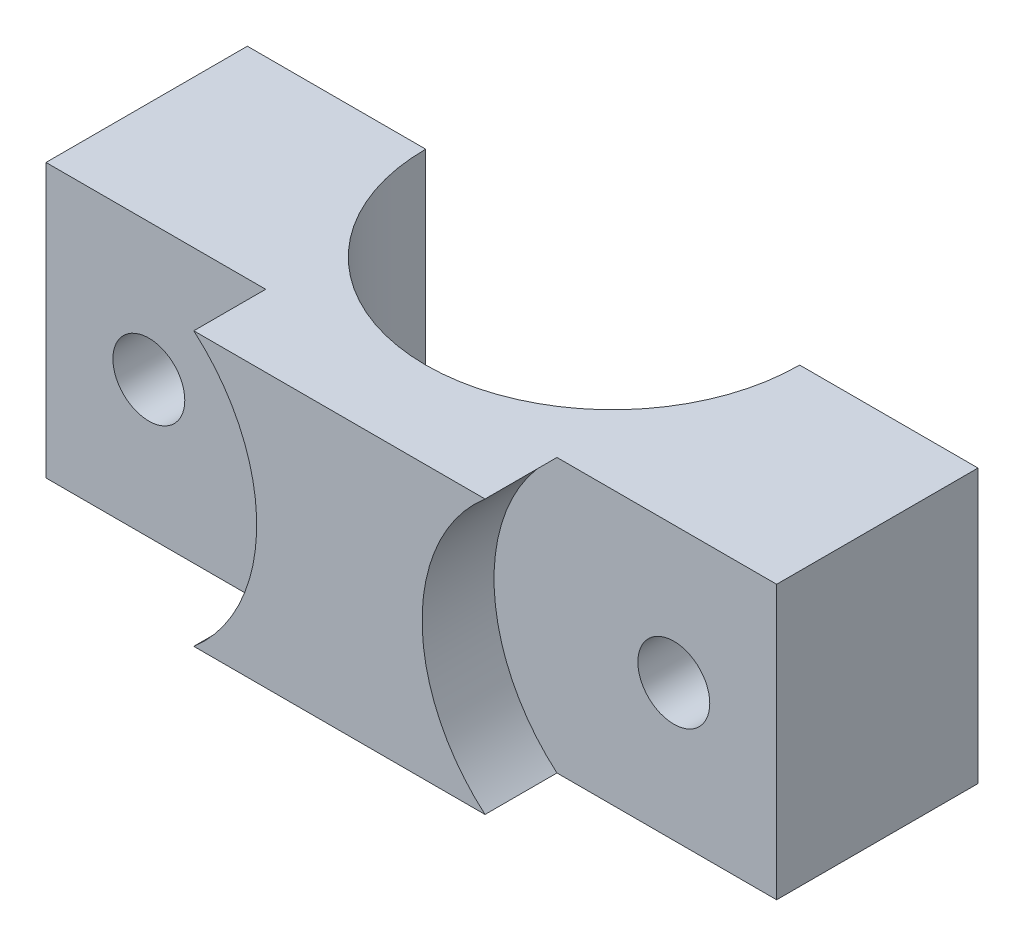
ISO-10303-21;
HEADER;
FILE_DESCRIPTION(('STEP AP214'),'2;1');
FILE_NAME('part.step','',(''),(''),'','','');
FILE_SCHEMA(('AUTOMOTIVE_DESIGN { 1 0 10303 214 1 1 1 1 }'));
ENDSEC;
DATA;
#1=APPLICATION_CONTEXT('core data for automotive mechanical design processes');
#2=APPLICATION_PROTOCOL_DEFINITION('international standard','automotive_design',2000,#1);
#3=PRODUCT_CONTEXT('',#1,'mechanical');
#4=PRODUCT('Part','Part','',(#3));
#5=PRODUCT_RELATED_PRODUCT_CATEGORY('part','',(#4));
#6=PRODUCT_DEFINITION_FORMATION('','',#4);
#7=PRODUCT_DEFINITION_CONTEXT('part definition',#1,'design');
#8=PRODUCT_DEFINITION('design','',#6,#7);
#9=PRODUCT_DEFINITION_SHAPE('','',#8);
#10=(LENGTH_UNIT() NAMED_UNIT(*) SI_UNIT(.MILLI.,.METRE.));
#11=(NAMED_UNIT(*) PLANE_ANGLE_UNIT() SI_UNIT($,.RADIAN.));
#12=(NAMED_UNIT(*) SI_UNIT($,.STERADIAN.) SOLID_ANGLE_UNIT());
#13=UNCERTAINTY_MEASURE_WITH_UNIT(LENGTH_MEASURE(1.E-05),#10,'distance_accuracy_value','');
#14=(GEOMETRIC_REPRESENTATION_CONTEXT(3) GLOBAL_UNCERTAINTY_ASSIGNED_CONTEXT((#13)) GLOBAL_UNIT_ASSIGNED_CONTEXT((#10,
#11,#12)) REPRESENTATION_CONTEXT('',''));
#15=CARTESIAN_POINT('',(0.,0.,0.));
#16=DIRECTION('',(0.,0.,1.));
#17=DIRECTION('',(1.,0.,0.));
#18=AXIS2_PLACEMENT_3D('',#15,#16,#17);
#19=CARTESIAN_POINT('',(25.4,9.5,19.));
#20=DIRECTION('',(-1.,0.,0.));
#21=DIRECTION('',(0.,0.,1.));
#22=AXIS2_PLACEMENT_3D('',#19,#20,#21);
#23=PLANE('',#22);
#24=DIRECTION('',(0.,1.,0.));
#25=VECTOR('',#24,1.);
#26=CARTESIAN_POINT('',(25.4,0.,14.));
#27=LINE('',#26,#25);
#28=CARTESIAN_POINT('',(25.4,-9.5,14.));
#29=VERTEX_POINT('',#28);
#30=CARTESIAN_POINT('',(25.4,9.5,14.));
#31=VERTEX_POINT('',#30);
#32=EDGE_CURVE('E145',#29,#31,#27,.T.);
#33=ORIENTED_EDGE('',*,*,#32,.F.);
#34=DIRECTION('',(0.,0.,-1.));
#35=VECTOR('',#34,1.);
#36=CARTESIAN_POINT('',(25.4,-9.5,19.));
#37=LINE('',#36,#35);
#38=CARTESIAN_POINT('',(25.4,-9.5,0.));
#39=VERTEX_POINT('',#38);
#40=EDGE_CURVE('E165',#29,#39,#37,.T.);
#41=ORIENTED_EDGE('',*,*,#40,.T.);
#42=DIRECTION('',(0.,1.,0.));
#43=VECTOR('',#42,1.);
#44=CARTESIAN_POINT('',(25.4,9.5,0.));
#45=LINE('',#44,#43);
#46=CARTESIAN_POINT('',(25.4,9.5,0.));
#47=VERTEX_POINT('',#46);
#48=EDGE_CURVE('E158',#39,#47,#45,.T.);
#49=ORIENTED_EDGE('',*,*,#48,.T.);
#50=DIRECTION('',(0.,0.,-1.));
#51=VECTOR('',#50,1.);
#52=CARTESIAN_POINT('',(25.4,9.5,19.));
#53=LINE('',#52,#51);
#54=EDGE_CURVE('E183',#31,#47,#53,.T.);
#55=ORIENTED_EDGE('',*,*,#54,.F.);
#56=EDGE_LOOP('',(#33,#41,#49,#55));
#57=FACE_BOUND('',#56,.T.);
#58=ADVANCED_FACE('F37',(#57),#23,.F.);
#59=CARTESIAN_POINT('',(-25.4,9.5,19.));
#60=DIRECTION('',(0.,-1.,0.));
#61=DIRECTION('',(0.,0.,-1.));
#62=AXIS2_PLACEMENT_3D('',#59,#60,#61);
#63=PLANE('',#62);
#64=DIRECTION('',(-1.,0.,0.));
#65=VECTOR('',#64,1.);
#66=CARTESIAN_POINT('',(0.,9.5,14.));
#67=LINE('',#66,#65);
#68=CARTESIAN_POINT('',(-10.125961595364,9.5,14.));
#69=VERTEX_POINT('',#68);
#70=CARTESIAN_POINT('',(-25.4,9.5,14.));
#71=VERTEX_POINT('',#70);
#72=EDGE_CURVE('E118',#69,#71,#67,.T.);
#73=ORIENTED_EDGE('',*,*,#72,.F.);
#74=DIRECTION('',(0.,0.,1.));
#75=VECTOR('',#74,1.);
#76=CARTESIAN_POINT('',(-10.125961595364,9.5,14.));
#77=LINE('',#76,#75);
#78=CARTESIAN_POINT('',(-10.125961595364,9.5,19.));
#79=VERTEX_POINT('',#78);
#80=EDGE_CURVE('E115',#69,#79,#77,.T.);
#81=ORIENTED_EDGE('',*,*,#80,.T.);
#82=DIRECTION('',(-1.,0.,0.));
#83=VECTOR('',#82,1.);
#84=CARTESIAN_POINT('',(-25.4,9.5,19.));
#85=LINE('',#84,#83);
#86=CARTESIAN_POINT('',(10.125961595364,9.5,19.));
#87=VERTEX_POINT('',#86);
#88=EDGE_CURVE('E160',#87,#79,#85,.T.);
#89=ORIENTED_EDGE('',*,*,#88,.F.);
#90=DIRECTION('',(0.,0.,1.));
#91=VECTOR('',#90,1.);
#92=CARTESIAN_POINT('',(10.125961595364,9.5,14.));
#93=LINE('',#92,#91);
#94=CARTESIAN_POINT('',(10.125961595364,9.5,14.));
#95=VERTEX_POINT('',#94);
#96=EDGE_CURVE('E59',#95,#87,#93,.T.);
#97=ORIENTED_EDGE('',*,*,#96,.F.);
#98=DIRECTION('',(-1.,0.,0.));
#99=VECTOR('',#98,1.);
#100=CARTESIAN_POINT('',(0.,9.5,14.));
#101=LINE('',#100,#99);
#102=EDGE_CURVE('E147',#31,#95,#101,.T.);
#103=ORIENTED_EDGE('',*,*,#102,.F.);
#104=ORIENTED_EDGE('',*,*,#54,.T.);
#105=DIRECTION('',(-1.,0.,0.));
#106=VECTOR('',#105,1.);
#107=CARTESIAN_POINT('',(-25.4,9.5,0.));
#108=LINE('',#107,#106);
#109=CARTESIAN_POINT('',(13.,9.5,0.));
#110=VERTEX_POINT('',#109);
#111=EDGE_CURVE('E169',#47,#110,#108,.T.);
#112=ORIENTED_EDGE('',*,*,#111,.T.);
#113=CARTESIAN_POINT('',(0.,9.5,0.));
#114=DIRECTION('',(0.,-1.,0.));
#115=DIRECTION('',(0.,0.,-1.));
#116=AXIS2_PLACEMENT_3D('',#113,#114,#115);
#117=CIRCLE('',#116,13.);
#118=CARTESIAN_POINT('',(-13.,9.5,0.));
#119=VERTEX_POINT('',#118);
#120=EDGE_CURVE('E155',#110,#119,#117,.T.);
#121=ORIENTED_EDGE('',*,*,#120,.T.);
#122=CARTESIAN_POINT('',(-25.4,9.5,0.));
#123=VERTEX_POINT('',#122);
#124=EDGE_CURVE('E168',#119,#123,#108,.T.);
#125=ORIENTED_EDGE('',*,*,#124,.T.);
#126=DIRECTION('',(0.,0.,-1.));
#127=VECTOR('',#126,1.);
#128=CARTESIAN_POINT('',(-25.4,9.5,19.));
#129=LINE('',#128,#127);
#130=EDGE_CURVE('E181',#71,#123,#129,.T.);
#131=ORIENTED_EDGE('',*,*,#130,.F.);
#132=EDGE_LOOP('',(#73,#81,#89,#97,#103,#104,#112,#121,#125,#131));
#133=FACE_BOUND('',#132,.T.);
#134=ADVANCED_FACE('F194',(#133),#63,.F.);
#135=CARTESIAN_POINT('',(-25.4,9.5,19.));
#136=DIRECTION('',(1.,0.,0.));
#137=DIRECTION('',(0.,0.,-1.));
#138=AXIS2_PLACEMENT_3D('',#135,#136,#137);
#139=PLANE('',#138);
#140=DIRECTION('',(0.,-1.,0.));
#141=VECTOR('',#140,1.);
#142=CARTESIAN_POINT('',(-25.4,0.,14.));
#143=LINE('',#142,#141);
#144=CARTESIAN_POINT('',(-25.4,-9.5,14.));
#145=VERTEX_POINT('',#144);
#146=EDGE_CURVE('E124',#71,#145,#143,.T.);
#147=ORIENTED_EDGE('',*,*,#146,.F.);
#148=ORIENTED_EDGE('',*,*,#130,.T.);
#149=DIRECTION('',(0.,-1.,0.));
#150=VECTOR('',#149,1.);
#151=CARTESIAN_POINT('',(-25.4,9.5,0.));
#152=LINE('',#151,#150);
#153=CARTESIAN_POINT('',(-25.4,-9.5,0.));
#154=VERTEX_POINT('',#153);
#155=EDGE_CURVE('E172',#123,#154,#152,.T.);
#156=ORIENTED_EDGE('',*,*,#155,.T.);
#157=DIRECTION('',(0.,0.,-1.));
#158=VECTOR('',#157,1.);
#159=CARTESIAN_POINT('',(-25.4,-9.5,19.));
#160=LINE('',#159,#158);
#161=EDGE_CURVE('E179',#145,#154,#160,.T.);
#162=ORIENTED_EDGE('',*,*,#161,.F.);
#163=EDGE_LOOP('',(#147,#148,#156,#162));
#164=FACE_BOUND('',#163,.T.);
#165=ADVANCED_FACE('F210',(#164),#139,.F.);
#166=CARTESIAN_POINT('',(-25.4,-9.5,19.));
#167=DIRECTION('',(0.,1.,0.));
#168=DIRECTION('',(0.,0.,1.));
#169=AXIS2_PLACEMENT_3D('',#166,#167,#168);
#170=PLANE('',#169);
#171=DIRECTION('',(1.,0.,0.));
#172=VECTOR('',#171,1.);
#173=CARTESIAN_POINT('',(-25.4,-9.5,19.));
#174=LINE('',#173,#172);
#175=CARTESIAN_POINT('',(-10.125961595364,-9.5,19.));
#176=VERTEX_POINT('',#175);
#177=CARTESIAN_POINT('',(10.125961595364,-9.5,19.));
#178=VERTEX_POINT('',#177);
#179=EDGE_CURVE('E133',#176,#178,#174,.T.);
#180=ORIENTED_EDGE('',*,*,#179,.F.);
#181=DIRECTION('',(0.,0.,1.));
#182=VECTOR('',#181,1.);
#183=CARTESIAN_POINT('',(-10.125961595364,-9.5,14.));
#184=LINE('',#183,#182);
#185=CARTESIAN_POINT('',(-10.125961595364,-9.5,14.));
#186=VERTEX_POINT('',#185);
#187=EDGE_CURVE('E51',#186,#176,#184,.T.);
#188=ORIENTED_EDGE('',*,*,#187,.F.);
#189=DIRECTION('',(1.,0.,0.));
#190=VECTOR('',#189,1.);
#191=CARTESIAN_POINT('',(0.,-9.5,14.));
#192=LINE('',#191,#190);
#193=EDGE_CURVE('E119',#145,#186,#192,.T.);
#194=ORIENTED_EDGE('',*,*,#193,.F.);
#195=ORIENTED_EDGE('',*,*,#161,.T.);
#196=DIRECTION('',(1.,0.,0.));
#197=VECTOR('',#196,1.);
#198=CARTESIAN_POINT('',(-25.4,-9.5,0.));
#199=LINE('',#198,#197);
#200=CARTESIAN_POINT('',(-13.,-9.5,0.));
#201=VERTEX_POINT('',#200);
#202=EDGE_CURVE('E163',#154,#201,#199,.T.);
#203=ORIENTED_EDGE('',*,*,#202,.T.);
#204=CARTESIAN_POINT('',(0.,-9.5,0.));
#205=DIRECTION('',(0.,-1.,0.));
#206=DIRECTION('',(0.,0.,-1.));
#207=AXIS2_PLACEMENT_3D('',#204,#205,#206);
#208=CIRCLE('',#207,13.);
#209=CARTESIAN_POINT('',(13.,-9.5,0.));
#210=VERTEX_POINT('',#209);
#211=EDGE_CURVE('E135',#210,#201,#208,.T.);
#212=ORIENTED_EDGE('',*,*,#211,.F.);
#213=EDGE_CURVE('E175',#210,#39,#199,.T.);
#214=ORIENTED_EDGE('',*,*,#213,.T.);
#215=ORIENTED_EDGE('',*,*,#40,.F.);
#216=DIRECTION('',(1.,0.,0.));
#217=VECTOR('',#216,1.);
#218=CARTESIAN_POINT('',(0.,-9.5,14.));
#219=LINE('',#218,#217);
#220=CARTESIAN_POINT('',(10.125961595364,-9.5,14.));
#221=VERTEX_POINT('',#220);
#222=EDGE_CURVE('E142',#221,#29,#219,.T.);
#223=ORIENTED_EDGE('',*,*,#222,.F.);
#224=DIRECTION('',(0.,0.,1.));
#225=VECTOR('',#224,1.);
#226=CARTESIAN_POINT('',(10.125961595364,-9.5,14.));
#227=LINE('',#226,#225);
#228=EDGE_CURVE('E150',#221,#178,#227,.T.);
#229=ORIENTED_EDGE('',*,*,#228,.T.);
#230=EDGE_LOOP('',(#180,#188,#194,#195,#203,#212,#214,#215,#223,#229));
#231=FACE_BOUND('',#230,.T.);
#232=ADVANCED_FACE('F130',(#231),#170,.F.);
#233=CARTESIAN_POINT('',(0.,0.,19.));
#234=DIRECTION('',(0.,0.,1.));
#235=DIRECTION('',(1.,0.,0.));
#236=AXIS2_PLACEMENT_3D('',#233,#234,#235);
#237=PLANE('',#236);
#238=CARTESIAN_POINT('',(-18.25,0.,19.));
#239=DIRECTION('',(0.,0.,1.));
#240=DIRECTION('',(1.,0.,0.));
#241=AXIS2_PLACEMENT_3D('',#238,#239,#240);
#242=CIRCLE('',#241,12.5);
#243=EDGE_CURVE('E127',#176,#79,#242,.T.);
#244=ORIENTED_EDGE('',*,*,#243,.F.);
#245=ORIENTED_EDGE('',*,*,#179,.T.);
#246=CARTESIAN_POINT('',(18.25,0.,19.));
#247=DIRECTION('',(0.,0.,1.));
#248=DIRECTION('',(1.,0.,0.));
#249=AXIS2_PLACEMENT_3D('',#246,#247,#248);
#250=CIRCLE('',#249,12.5);
#251=EDGE_CURVE('E143',#178,#87,#250,.F.);
#252=ORIENTED_EDGE('',*,*,#251,.T.);
#253=ORIENTED_EDGE('',*,*,#88,.T.);
#254=EDGE_LOOP('',(#244,#245,#252,#253));
#255=FACE_BOUND('',#254,.T.);
#256=ADVANCED_FACE('F217',(#255),#237,.T.);
#257=CARTESIAN_POINT('',(0.,0.,0.));
#258=DIRECTION('',(0.,0.,1.));
#259=DIRECTION('',(1.,0.,0.));
#260=AXIS2_PLACEMENT_3D('',#257,#258,#259);
#261=PLANE('',#260);
#262=CARTESIAN_POINT('',(-18.25,0.,0.));
#263=DIRECTION('',(0.,0.,1.));
#264=DIRECTION('',(1.,0.,0.));
#265=AXIS2_PLACEMENT_3D('',#262,#263,#264);
#266=CIRCLE('',#265,2.5);
#267=CARTESIAN_POINT('',(-15.75,0.,0.));
#268=VERTEX_POINT('',#267);
#269=EDGE_CURVE('E366',#268,#268,#266,.T.);
#270=ORIENTED_EDGE('',*,*,#269,.T.);
#271=EDGE_LOOP('',(#270));
#272=FACE_BOUND('',#271,.T.);
#273=ORIENTED_EDGE('',*,*,#124,.F.);
#274=DIRECTION('',(0.,-1.,0.));
#275=VECTOR('',#274,1.);
#276=CARTESIAN_POINT('',(-13.,9.5,0.));
#277=LINE('',#276,#275);
#278=EDGE_CURVE('E11',#119,#201,#277,.T.);
#279=ORIENTED_EDGE('',*,*,#278,.T.);
#280=ORIENTED_EDGE('',*,*,#202,.F.);
#281=ORIENTED_EDGE('',*,*,#155,.F.);
#282=EDGE_LOOP('',(#273,#279,#280,#281));
#283=FACE_BOUND('',#282,.T.);
#284=ADVANCED_FACE('F206',(#272,#283),#261,.F.);
#285=CARTESIAN_POINT('',(18.25,0.,0.));
#286=DIRECTION('',(0.,0.,1.));
#287=DIRECTION('',(1.,0.,0.));
#288=AXIS2_PLACEMENT_3D('',#285,#286,#287);
#289=CIRCLE('',#288,2.5);
#290=CARTESIAN_POINT('',(20.75,0.,0.));
#291=VERTEX_POINT('',#290);
#292=EDGE_CURVE('E365',#291,#291,#289,.T.);
#293=ORIENTED_EDGE('',*,*,#292,.T.);
#294=EDGE_LOOP('',(#293));
#295=FACE_BOUND('',#294,.T.);
#296=ORIENTED_EDGE('',*,*,#213,.F.);
#297=DIRECTION('',(0.,-1.,0.));
#298=VECTOR('',#297,1.);
#299=CARTESIAN_POINT('',(13.,9.5,0.));
#300=LINE('',#299,#298);
#301=EDGE_CURVE('E44',#210,#110,#300,.F.);
#302=ORIENTED_EDGE('',*,*,#301,.T.);
#303=ORIENTED_EDGE('',*,*,#111,.F.);
#304=ORIENTED_EDGE('',*,*,#48,.F.);
#305=EDGE_LOOP('',(#296,#302,#303,#304));
#306=FACE_BOUND('',#305,.T.);
#307=ADVANCED_FACE('F188',(#295,#306),#261,.F.);
#308=CARTESIAN_POINT('',(0.,9.5,0.));
#309=DIRECTION('',(0.,-1.,0.));
#310=DIRECTION('',(0.,0.,-1.));
#311=AXIS2_PLACEMENT_3D('',#308,#309,#310);
#312=CYLINDRICAL_SURFACE('',#311,13.);
#313=ORIENTED_EDGE('',*,*,#120,.F.);
#314=ORIENTED_EDGE('',*,*,#301,.F.);
#315=ORIENTED_EDGE('',*,*,#211,.T.);
#316=ORIENTED_EDGE('',*,*,#278,.F.);
#317=EDGE_LOOP('',(#313,#314,#315,#316));
#318=FACE_BOUND('',#317,.T.);
#319=ADVANCED_FACE('F204',(#318),#312,.F.);
#320=CARTESIAN_POINT('',(18.25,0.,14.));
#321=DIRECTION('',(0.,0.,1.));
#322=DIRECTION('',(1.,0.,0.));
#323=AXIS2_PLACEMENT_3D('',#320,#321,#322);
#324=CYLINDRICAL_SURFACE('',#323,12.5);
#325=ORIENTED_EDGE('',*,*,#251,.F.);
#326=ORIENTED_EDGE('',*,*,#228,.F.);
#327=CARTESIAN_POINT('',(18.25,0.,14.));
#328=DIRECTION('',(0.,0.,1.));
#329=DIRECTION('',(1.,0.,0.));
#330=AXIS2_PLACEMENT_3D('',#327,#328,#329);
#331=CIRCLE('',#330,12.5);
#332=EDGE_CURVE('E140',#221,#95,#331,.F.);
#333=ORIENTED_EDGE('',*,*,#332,.T.);
#334=ORIENTED_EDGE('',*,*,#96,.T.);
#335=EDGE_LOOP('',(#325,#326,#333,#334));
#336=FACE_BOUND('',#335,.T.);
#337=ADVANCED_FACE('F253',(#336),#324,.F.);
#338=CARTESIAN_POINT('',(0.,0.,14.));
#339=DIRECTION('',(0.,0.,1.));
#340=DIRECTION('',(1.,0.,0.));
#341=AXIS2_PLACEMENT_3D('',#338,#339,#340);
#342=PLANE('',#341);
#343=ORIENTED_EDGE('',*,*,#332,.F.);
#344=ORIENTED_EDGE('',*,*,#222,.T.);
#345=ORIENTED_EDGE('',*,*,#32,.T.);
#346=ORIENTED_EDGE('',*,*,#102,.T.);
#347=EDGE_LOOP('',(#343,#344,#345,#346));
#348=FACE_BOUND('',#347,.T.);
#349=CARTESIAN_POINT('',(18.25,0.,14.));
#350=DIRECTION('',(0.,0.,1.));
#351=DIRECTION('',(1.,0.,0.));
#352=AXIS2_PLACEMENT_3D('',#349,#350,#351);
#353=CIRCLE('',#352,2.5);
#354=CARTESIAN_POINT('',(20.75,0.,14.));
#355=VERTEX_POINT('',#354);
#356=EDGE_CURVE('E362',#355,#355,#353,.T.);
#357=ORIENTED_EDGE('',*,*,#356,.F.);
#358=EDGE_LOOP('',(#357));
#359=FACE_BOUND('',#358,.T.);
#360=ADVANCED_FACE('F258',(#348,#359),#342,.T.);
#361=CARTESIAN_POINT('',(-18.25,0.,14.));
#362=DIRECTION('',(0.,0.,1.));
#363=DIRECTION('',(1.,0.,0.));
#364=AXIS2_PLACEMENT_3D('',#361,#362,#363);
#365=CYLINDRICAL_SURFACE('',#364,12.5);
#366=ORIENTED_EDGE('',*,*,#243,.T.);
#367=ORIENTED_EDGE('',*,*,#80,.F.);
#368=CARTESIAN_POINT('',(-18.25,0.,14.));
#369=DIRECTION('',(0.,0.,1.));
#370=DIRECTION('',(1.,0.,0.));
#371=AXIS2_PLACEMENT_3D('',#368,#369,#370);
#372=CIRCLE('',#371,12.5);
#373=EDGE_CURVE('E111',#186,#69,#372,.T.);
#374=ORIENTED_EDGE('',*,*,#373,.F.);
#375=ORIENTED_EDGE('',*,*,#187,.T.);
#376=EDGE_LOOP('',(#366,#367,#374,#375));
#377=FACE_BOUND('',#376,.T.);
#378=ADVANCED_FACE('F113',(#377),#365,.F.);
#379=CARTESIAN_POINT('',(0.,0.,14.));
#380=DIRECTION('',(0.,0.,1.));
#381=DIRECTION('',(1.,0.,0.));
#382=AXIS2_PLACEMENT_3D('',#379,#380,#381);
#383=PLANE('',#382);
#384=CARTESIAN_POINT('',(-18.25,0.,14.));
#385=DIRECTION('',(0.,0.,1.));
#386=DIRECTION('',(1.,0.,0.));
#387=AXIS2_PLACEMENT_3D('',#384,#385,#386);
#388=CIRCLE('',#387,2.5);
#389=CARTESIAN_POINT('',(-15.75,0.,14.));
#390=VERTEX_POINT('',#389);
#391=EDGE_CURVE('E152',#390,#390,#388,.T.);
#392=ORIENTED_EDGE('',*,*,#391,.F.);
#393=EDGE_LOOP('',(#392));
#394=FACE_BOUND('',#393,.T.);
#395=ORIENTED_EDGE('',*,*,#193,.T.);
#396=ORIENTED_EDGE('',*,*,#373,.T.);
#397=ORIENTED_EDGE('',*,*,#72,.T.);
#398=ORIENTED_EDGE('',*,*,#146,.T.);
#399=EDGE_LOOP('',(#395,#396,#397,#398));
#400=FACE_BOUND('',#399,.T.);
#401=ADVANCED_FACE('F122',(#394,#400),#383,.T.);
#402=CARTESIAN_POINT('',(-18.25,0.,0.));
#403=DIRECTION('',(0.,0.,1.));
#404=DIRECTION('',(1.,0.,0.));
#405=AXIS2_PLACEMENT_3D('',#402,#403,#404);
#406=CYLINDRICAL_SURFACE('',#405,2.5);
#407=ORIENTED_EDGE('',*,*,#391,.T.);
#408=EDGE_LOOP('',(#407));
#409=FACE_BOUND('',#408,.T.);
#410=ORIENTED_EDGE('',*,*,#269,.F.);
#411=EDGE_LOOP('',(#410));
#412=FACE_BOUND('',#411,.T.);
#413=ADVANCED_FACE('F289',(#409,#412),#406,.F.);
#414=CARTESIAN_POINT('',(18.25,0.,0.));
#415=DIRECTION('',(0.,0.,1.));
#416=DIRECTION('',(1.,0.,0.));
#417=AXIS2_PLACEMENT_3D('',#414,#415,#416);
#418=CYLINDRICAL_SURFACE('',#417,2.5);
#419=ORIENTED_EDGE('',*,*,#356,.T.);
#420=EDGE_LOOP('',(#419));
#421=FACE_BOUND('',#420,.T.);
#422=ORIENTED_EDGE('',*,*,#292,.F.);
#423=EDGE_LOOP('',(#422));
#424=FACE_BOUND('',#423,.T.);
#425=ADVANCED_FACE('F317',(#421,#424),#418,.F.);
#426=CLOSED_SHELL('',(#58,#134,#165,#232,#256,#284,#307,#319,#337,#360,#378,#401,#413,#425));
#427=MANIFOLD_SOLID_BREP('B2',#426);
#428=ADVANCED_BREP_SHAPE_REPRESENTATION('',(#18,#427),#14);
#429=SHAPE_DEFINITION_REPRESENTATION(#9,#428);
ENDSEC;
END-ISO-10303-21;
